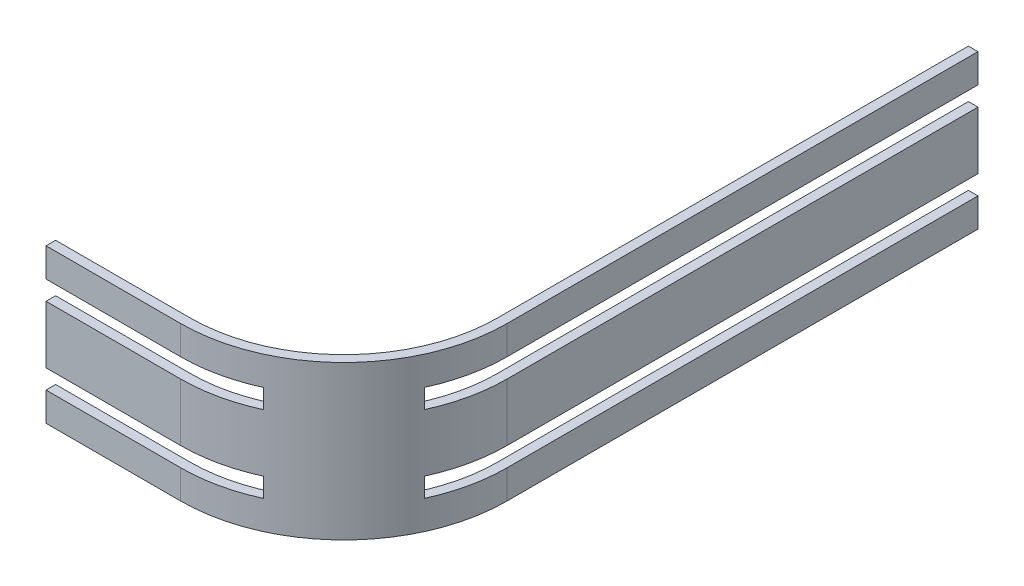
ISO-10303-21;
HEADER;
FILE_DESCRIPTION(('STEP AP214'),'2;1');
FILE_NAME('part.step','',(''),(''),'','','');
FILE_SCHEMA(('AUTOMOTIVE_DESIGN { 1 0 10303 214 1 1 1 1 }'));
ENDSEC;
DATA;
#1=APPLICATION_CONTEXT('core data for automotive mechanical design processes');
#2=APPLICATION_PROTOCOL_DEFINITION('international standard','automotive_design',2000,#1);
#3=PRODUCT_CONTEXT('',#1,'mechanical');
#4=PRODUCT('Part','Part','',(#3));
#5=PRODUCT_RELATED_PRODUCT_CATEGORY('part','',(#4));
#6=PRODUCT_DEFINITION_FORMATION('','',#4);
#7=PRODUCT_DEFINITION_CONTEXT('part definition',#1,'design');
#8=PRODUCT_DEFINITION('design','',#6,#7);
#9=PRODUCT_DEFINITION_SHAPE('','',#8);
#10=(LENGTH_UNIT() NAMED_UNIT(*) SI_UNIT(.MILLI.,.METRE.));
#11=(NAMED_UNIT(*) PLANE_ANGLE_UNIT() SI_UNIT($,.RADIAN.));
#12=(NAMED_UNIT(*) SI_UNIT($,.STERADIAN.) SOLID_ANGLE_UNIT());
#13=UNCERTAINTY_MEASURE_WITH_UNIT(LENGTH_MEASURE(1.E-05),#10,'distance_accuracy_value','');
#14=(GEOMETRIC_REPRESENTATION_CONTEXT(3) GLOBAL_UNCERTAINTY_ASSIGNED_CONTEXT((#13)) GLOBAL_UNIT_ASSIGNED_CONTEXT((#10,
#11,#12)) REPRESENTATION_CONTEXT('',''));
#15=CARTESIAN_POINT('',(0.,0.,0.));
#16=DIRECTION('',(0.,0.,1.));
#17=DIRECTION('',(1.,0.,0.));
#18=AXIS2_PLACEMENT_3D('',#15,#16,#17);
#19=CARTESIAN_POINT('',(-0.999999999999997,-3.,16.5));
#20=DIRECTION('',(0.,-1.,0.));
#21=DIRECTION('',(0.,0.,-1.));
#22=AXIS2_PLACEMENT_3D('',#19,#20,#21);
#23=PLANE('',#22);
#24=DIRECTION('',(0.,0.,-1.));
#25=VECTOR('',#24,1.);
#26=CARTESIAN_POINT('',(6.07499999999999,-3.,31.9578256879808));
#27=LINE('',#26,#25);
#28=CARTESIAN_POINT('',(6.07499999999999,-3.,31.9578256879808));
#29=VERTEX_POINT('',#28);
#30=CARTESIAN_POINT('',(6.07499999999999,-3.,30.8507621748812));
#31=VERTEX_POINT('',#30);
#32=EDGE_CURVE('E510',#29,#31,#27,.T.);
#33=ORIENTED_EDGE('',*,*,#32,.F.);
#34=CARTESIAN_POINT('',(-0.999999999999997,-3.,16.5));
#35=DIRECTION('',(0.,1.,0.));
#36=DIRECTION('',(0.,0.,-1.));
#37=AXIS2_PLACEMENT_3D('',#34,#35,#36);
#38=CIRCLE('',#37,17.);
#39=CARTESIAN_POINT('',(-1.00000000000012,-3.,33.5));
#40=VERTEX_POINT('',#39);
#41=EDGE_CURVE('E418',#40,#29,#38,.T.);
#42=ORIENTED_EDGE('',*,*,#41,.F.);
#43=DIRECTION('',(1.,0.,0.));
#44=VECTOR('',#43,1.);
#45=CARTESIAN_POINT('',(-15.,-3.,33.5));
#46=LINE('',#45,#44);
#47=CARTESIAN_POINT('',(-15.,-3.,33.5));
#48=VERTEX_POINT('',#47);
#49=EDGE_CURVE('E427',#48,#40,#46,.T.);
#50=ORIENTED_EDGE('',*,*,#49,.F.);
#51=DIRECTION('',(0.,0.,1.));
#52=VECTOR('',#51,1.);
#53=CARTESIAN_POINT('',(-15.,-3.,32.5));
#54=LINE('',#53,#52);
#55=CARTESIAN_POINT('',(-15.,-3.,32.5));
#56=VERTEX_POINT('',#55);
#57=EDGE_CURVE('E693',#56,#48,#54,.T.);
#58=ORIENTED_EDGE('',*,*,#57,.F.);
#59=DIRECTION('',(-1.,0.,0.));
#60=VECTOR('',#59,1.);
#61=CARTESIAN_POINT('',(-1.00000000000011,-3.,32.5));
#62=LINE('',#61,#60);
#63=CARTESIAN_POINT('',(-1.0000000000001,-3.,32.5));
#64=VERTEX_POINT('',#63);
#65=EDGE_CURVE('E498',#64,#56,#62,.T.);
#66=ORIENTED_EDGE('',*,*,#65,.F.);
#67=CARTESIAN_POINT('',(-0.999999999999997,-3.,16.5));
#68=DIRECTION('',(0.,-1.,0.));
#69=DIRECTION('',(0.,0.,-1.));
#70=AXIS2_PLACEMENT_3D('',#67,#68,#69);
#71=CIRCLE('',#70,16.);
#72=EDGE_CURVE('E50',#31,#64,#71,.T.);
#73=ORIENTED_EDGE('',*,*,#72,.F.);
#74=EDGE_LOOP('',(#33,#42,#50,#58,#66,#73));
#75=FACE_BOUND('',#74,.T.);
#76=ADVANCED_FACE('F32',(#75),#23,.T.);
#77=CARTESIAN_POINT('',(-0.999999999999997,3.,16.5));
#78=DIRECTION('',(0.,-1.,0.));
#79=DIRECTION('',(0.,0.,-1.));
#80=AXIS2_PLACEMENT_3D('',#77,#78,#79);
#81=PLANE('',#80);
#82=DIRECTION('',(0.,0.,1.));
#83=VECTOR('',#82,1.);
#84=CARTESIAN_POINT('',(6.07499999999999,3.,30.8507621748812));
#85=LINE('',#84,#83);
#86=CARTESIAN_POINT('',(6.07499999999999,3.,30.8507621748812));
#87=VERTEX_POINT('',#86);
#88=CARTESIAN_POINT('',(6.07499999999999,3.,31.9578256879808));
#89=VERTEX_POINT('',#88);
#90=EDGE_CURVE('E380',#87,#89,#85,.T.);
#91=ORIENTED_EDGE('',*,*,#90,.F.);
#92=CARTESIAN_POINT('',(-0.999999999999997,3.,16.5));
#93=DIRECTION('',(0.,-1.,0.));
#94=DIRECTION('',(0.,0.,-1.));
#95=AXIS2_PLACEMENT_3D('',#92,#93,#94);
#96=CIRCLE('',#95,16.);
#97=CARTESIAN_POINT('',(-1.0000000000001,3.,32.5));
#98=VERTEX_POINT('',#97);
#99=EDGE_CURVE('E457',#87,#98,#96,.T.);
#100=ORIENTED_EDGE('',*,*,#99,.T.);
#101=DIRECTION('',(-1.,0.,0.));
#102=VECTOR('',#101,1.);
#103=CARTESIAN_POINT('',(-1.00000000000011,3.,32.5));
#104=LINE('',#103,#102);
#105=CARTESIAN_POINT('',(-15.,3.,32.5));
#106=VERTEX_POINT('',#105);
#107=EDGE_CURVE('E456',#98,#106,#104,.T.);
#108=ORIENTED_EDGE('',*,*,#107,.T.);
#109=DIRECTION('',(0.,0.,1.));
#110=VECTOR('',#109,1.);
#111=CARTESIAN_POINT('',(-15.,3.,32.5));
#112=LINE('',#111,#110);
#113=CARTESIAN_POINT('',(-15.,3.,33.5));
#114=VERTEX_POINT('',#113);
#115=EDGE_CURVE('E464',#106,#114,#112,.T.);
#116=ORIENTED_EDGE('',*,*,#115,.T.);
#117=DIRECTION('',(1.,0.,0.));
#118=VECTOR('',#117,1.);
#119=CARTESIAN_POINT('',(-15.,3.,33.5));
#120=LINE('',#119,#118);
#121=CARTESIAN_POINT('',(-1.00000000000012,3.,33.5));
#122=VERTEX_POINT('',#121);
#123=EDGE_CURVE('E466',#114,#122,#120,.T.);
#124=ORIENTED_EDGE('',*,*,#123,.T.);
#125=CARTESIAN_POINT('',(-0.999999999999997,3.,16.5));
#126=DIRECTION('',(0.,1.,0.));
#127=DIRECTION('',(0.,0.,-1.));
#128=AXIS2_PLACEMENT_3D('',#125,#126,#127);
#129=CIRCLE('',#128,17.);
#130=EDGE_CURVE('E471',#122,#89,#129,.T.);
#131=ORIENTED_EDGE('',*,*,#130,.T.);
#132=EDGE_LOOP('',(#91,#100,#108,#116,#124,#131));
#133=FACE_BOUND('',#132,.T.);
#134=ADVANCED_FACE('F491',(#133),#81,.F.);
#135=DIRECTION('',(-1.,0.,0.));
#136=VECTOR('',#135,1.);
#137=CARTESIAN_POINT('',(13.3507621748812,3.,23.575));
#138=LINE('',#137,#136);
#139=CARTESIAN_POINT('',(14.4578256879808,3.,23.575));
#140=VERTEX_POINT('',#139);
#141=CARTESIAN_POINT('',(13.3507621748812,3.,23.575));
#142=VERTEX_POINT('',#141);
#143=EDGE_CURVE('E395',#140,#142,#138,.T.);
#144=ORIENTED_EDGE('',*,*,#143,.F.);
#145=CARTESIAN_POINT('',(16.,3.,16.4999999999999));
#146=VERTEX_POINT('',#145);
#147=EDGE_CURVE('E400',#140,#146,#129,.T.);
#148=ORIENTED_EDGE('',*,*,#147,.T.);
#149=DIRECTION('',(0.,0.,-1.));
#150=VECTOR('',#149,1.);
#151=CARTESIAN_POINT('',(16.,3.,16.4999999999999));
#152=LINE('',#151,#150);
#153=CARTESIAN_POINT('',(16.,3.,-32.5));
#154=VERTEX_POINT('',#153);
#155=EDGE_CURVE('E436',#146,#154,#152,.T.);
#156=ORIENTED_EDGE('',*,*,#155,.T.);
#157=DIRECTION('',(-1.,0.,0.));
#158=VECTOR('',#157,1.);
#159=CARTESIAN_POINT('',(16.,3.,-32.5));
#160=LINE('',#159,#158);
#161=CARTESIAN_POINT('',(15.,3.,-32.5));
#162=VERTEX_POINT('',#161);
#163=EDGE_CURVE('E431',#154,#162,#160,.T.);
#164=ORIENTED_EDGE('',*,*,#163,.T.);
#165=DIRECTION('',(0.,0.,1.));
#166=VECTOR('',#165,1.);
#167=CARTESIAN_POINT('',(15.,3.,-32.5));
#168=LINE('',#167,#166);
#169=CARTESIAN_POINT('',(15.,3.,16.4999999999999));
#170=VERTEX_POINT('',#169);
#171=EDGE_CURVE('E461',#162,#170,#168,.T.);
#172=ORIENTED_EDGE('',*,*,#171,.T.);
#173=EDGE_CURVE('E453',#170,#142,#96,.T.);
#174=ORIENTED_EDGE('',*,*,#173,.T.);
#175=EDGE_LOOP('',(#144,#148,#156,#164,#172,#174));
#176=FACE_BOUND('',#175,.T.);
#177=ADVANCED_FACE('F475',(#176),#81,.F.);
#178=CARTESIAN_POINT('',(16.,3.,-32.5));
#179=DIRECTION('',(0.,0.,1.));
#180=DIRECTION('',(1.,0.,0.));
#181=AXIS2_PLACEMENT_3D('',#178,#179,#180);
#182=PLANE('',#181);
#183=DIRECTION('',(-1.,0.,0.));
#184=VECTOR('',#183,1.);
#185=CARTESIAN_POINT('',(16.,-3.,-32.5));
#186=LINE('',#185,#184);
#187=CARTESIAN_POINT('',(16.,-3.,-32.5));
#188=VERTEX_POINT('',#187);
#189=CARTESIAN_POINT('',(15.,-3.,-32.5));
#190=VERTEX_POINT('',#189);
#191=EDGE_CURVE('E408',#188,#190,#186,.T.);
#192=ORIENTED_EDGE('',*,*,#191,.T.);
#193=DIRECTION('',(0.,-1.,0.));
#194=VECTOR('',#193,1.);
#195=CARTESIAN_POINT('',(15.,3.,-32.5));
#196=LINE('',#195,#194);
#197=EDGE_CURVE('E11',#162,#190,#196,.T.);
#198=ORIENTED_EDGE('',*,*,#197,.F.);
#199=ORIENTED_EDGE('',*,*,#163,.F.);
#200=DIRECTION('',(0.,-1.,0.));
#201=VECTOR('',#200,1.);
#202=CARTESIAN_POINT('',(16.,3.,-32.5));
#203=LINE('',#202,#201);
#204=EDGE_CURVE('E432',#154,#188,#203,.T.);
#205=ORIENTED_EDGE('',*,*,#204,.T.);
#206=EDGE_LOOP('',(#192,#198,#199,#205));
#207=FACE_BOUND('',#206,.T.);
#208=ADVANCED_FACE('F34',(#207),#182,.F.);
#209=CARTESIAN_POINT('',(15.,3.,-32.5));
#210=DIRECTION('',(1.,0.,0.));
#211=DIRECTION('',(0.,0.,-1.));
#212=AXIS2_PLACEMENT_3D('',#209,#210,#211);
#213=PLANE('',#212);
#214=DIRECTION('',(0.,0.,1.));
#215=VECTOR('',#214,1.);
#216=CARTESIAN_POINT('',(15.,-3.,-32.5));
#217=LINE('',#216,#215);
#218=CARTESIAN_POINT('',(15.,-3.,16.4999999999999));
#219=VERTEX_POINT('',#218);
#220=EDGE_CURVE('E690',#190,#219,#217,.T.);
#221=ORIENTED_EDGE('',*,*,#220,.T.);
#222=DIRECTION('',(0.,-1.,0.));
#223=VECTOR('',#222,1.);
#224=CARTESIAN_POINT('',(15.,3.,16.4999999999999));
#225=LINE('',#224,#223);
#226=EDGE_CURVE('E42',#170,#219,#225,.T.);
#227=ORIENTED_EDGE('',*,*,#226,.F.);
#228=ORIENTED_EDGE('',*,*,#171,.F.);
#229=ORIENTED_EDGE('',*,*,#197,.T.);
#230=EDGE_LOOP('',(#221,#227,#228,#229));
#231=FACE_BOUND('',#230,.T.);
#232=ADVANCED_FACE('F684',(#231),#213,.F.);
#233=CARTESIAN_POINT('',(-0.999999999999997,3.,16.5));
#234=DIRECTION('',(0.,-1.,0.));
#235=DIRECTION('',(0.,0.,-1.));
#236=AXIS2_PLACEMENT_3D('',#233,#234,#235);
#237=CYLINDRICAL_SURFACE('',#236,16.);
#238=CARTESIAN_POINT('',(13.3507621748812,-3.,23.575));
#239=VERTEX_POINT('',#238);
#240=EDGE_CURVE('E543',#219,#239,#71,.T.);
#241=ORIENTED_EDGE('',*,*,#240,.T.);
#242=DIRECTION('',(0.,1.,0.));
#243=VECTOR('',#242,1.);
#244=CARTESIAN_POINT('',(13.3507621748812,-5.,23.575));
#245=LINE('',#244,#243);
#246=CARTESIAN_POINT('',(13.3507621748812,-5.,23.575));
#247=VERTEX_POINT('',#246);
#248=EDGE_CURVE('E399',#247,#239,#245,.T.);
#249=ORIENTED_EDGE('',*,*,#248,.F.);
#250=CARTESIAN_POINT('',(-0.999999999999997,-5.,16.5));
#251=DIRECTION('',(0.,1.,0.));
#252=DIRECTION('',(0.,0.,-1.));
#253=AXIS2_PLACEMENT_3D('',#250,#251,#252);
#254=CIRCLE('',#253,16.);
#255=CARTESIAN_POINT('',(15.,-5.,16.4999999999999));
#256=VERTEX_POINT('',#255);
#257=EDGE_CURVE('E541',#247,#256,#254,.T.);
#258=ORIENTED_EDGE('',*,*,#257,.T.);
#259=DIRECTION('',(0.,1.,0.));
#260=VECTOR('',#259,1.);
#261=CARTESIAN_POINT('',(15.,-8.,16.4999999999999));
#262=LINE('',#261,#260);
#263=CARTESIAN_POINT('',(15.,-8.,16.4999999999999));
#264=VERTEX_POINT('',#263);
#265=EDGE_CURVE('E579',#264,#256,#262,.T.);
#266=ORIENTED_EDGE('',*,*,#265,.F.);
#267=CARTESIAN_POINT('',(-0.999999999999997,-8.,16.5));
#268=DIRECTION('',(0.,1.,0.));
#269=DIRECTION('',(0.,0.,-1.));
#270=AXIS2_PLACEMENT_3D('',#267,#268,#269);
#271=CIRCLE('',#270,16.);
#272=CARTESIAN_POINT('',(-1.0000000000001,-8.,32.5));
#273=VERTEX_POINT('',#272);
#274=EDGE_CURVE('E627',#273,#264,#271,.T.);
#275=ORIENTED_EDGE('',*,*,#274,.F.);
#276=DIRECTION('',(0.,1.,0.));
#277=VECTOR('',#276,1.);
#278=CARTESIAN_POINT('',(-1.0000000000001,-8.,32.5));
#279=LINE('',#278,#277);
#280=CARTESIAN_POINT('',(-1.0000000000001,-5.,32.5));
#281=VERTEX_POINT('',#280);
#282=EDGE_CURVE('E581',#273,#281,#279,.T.);
#283=ORIENTED_EDGE('',*,*,#282,.T.);
#284=CARTESIAN_POINT('',(6.07499999999999,-5.,30.8507621748812));
#285=VERTEX_POINT('',#284);
#286=EDGE_CURVE('E550',#281,#285,#254,.T.);
#287=ORIENTED_EDGE('',*,*,#286,.T.);
#288=DIRECTION('',(0.,1.,0.));
#289=VECTOR('',#288,1.);
#290=CARTESIAN_POINT('',(6.07499999999999,-5.,30.8507621748812));
#291=LINE('',#290,#289);
#292=EDGE_CURVE('E521',#285,#31,#291,.T.);
#293=ORIENTED_EDGE('',*,*,#292,.T.);
#294=ORIENTED_EDGE('',*,*,#72,.T.);
#295=DIRECTION('',(0.,-1.,0.));
#296=VECTOR('',#295,1.);
#297=CARTESIAN_POINT('',(-1.0000000000001,3.,32.5));
#298=LINE('',#297,#296);
#299=EDGE_CURVE('E448',#98,#64,#298,.T.);
#300=ORIENTED_EDGE('',*,*,#299,.F.);
#301=ORIENTED_EDGE('',*,*,#99,.F.);
#302=DIRECTION('',(0.,-1.,0.));
#303=VECTOR('',#302,1.);
#304=CARTESIAN_POINT('',(6.07499999999999,5.,30.8507621748812));
#305=LINE('',#304,#303);
#306=CARTESIAN_POINT('',(6.07499999999999,5.,30.8507621748812));
#307=VERTEX_POINT('',#306);
#308=EDGE_CURVE('E378',#307,#87,#305,.T.);
#309=ORIENTED_EDGE('',*,*,#308,.F.);
#310=CARTESIAN_POINT('',(-0.999999999999997,5.,16.5));
#311=DIRECTION('',(0.,-1.,0.));
#312=DIRECTION('',(0.,0.,1.));
#313=AXIS2_PLACEMENT_3D('',#310,#311,#312);
#314=CIRCLE('',#313,16.);
#315=CARTESIAN_POINT('',(-1.0000000000001,5.,32.5));
#316=VERTEX_POINT('',#315);
#317=EDGE_CURVE('E319',#307,#316,#314,.T.);
#318=ORIENTED_EDGE('',*,*,#317,.T.);
#319=DIRECTION('',(0.,-1.,0.));
#320=VECTOR('',#319,1.);
#321=CARTESIAN_POINT('',(-1.0000000000001,8.,32.5));
#322=LINE('',#321,#320);
#323=CARTESIAN_POINT('',(-1.0000000000001,8.,32.5));
#324=VERTEX_POINT('',#323);
#325=EDGE_CURVE('E301',#324,#316,#322,.T.);
#326=ORIENTED_EDGE('',*,*,#325,.F.);
#327=CARTESIAN_POINT('',(-0.999999999999997,8.,16.5));
#328=DIRECTION('',(0.,-1.,0.));
#329=DIRECTION('',(0.,0.,1.));
#330=AXIS2_PLACEMENT_3D('',#327,#328,#329);
#331=CIRCLE('',#330,16.);
#332=CARTESIAN_POINT('',(15.,8.,16.4999999999999));
#333=VERTEX_POINT('',#332);
#334=EDGE_CURVE('E312',#333,#324,#331,.T.);
#335=ORIENTED_EDGE('',*,*,#334,.F.);
#336=DIRECTION('',(0.,-1.,0.));
#337=VECTOR('',#336,1.);
#338=CARTESIAN_POINT('',(15.,8.,16.4999999999999));
#339=LINE('',#338,#337);
#340=CARTESIAN_POINT('',(15.,5.,16.4999999999999));
#341=VERTEX_POINT('',#340);
#342=EDGE_CURVE('E275',#333,#341,#339,.T.);
#343=ORIENTED_EDGE('',*,*,#342,.T.);
#344=CARTESIAN_POINT('',(13.3507621748812,5.,23.575));
#345=VERTEX_POINT('',#344);
#346=EDGE_CURVE('E310',#341,#345,#314,.T.);
#347=ORIENTED_EDGE('',*,*,#346,.T.);
#348=DIRECTION('',(0.,-1.,0.));
#349=VECTOR('',#348,1.);
#350=CARTESIAN_POINT('',(13.3507621748812,5.,23.575));
#351=LINE('',#350,#349);
#352=EDGE_CURVE('E403',#345,#142,#351,.T.);
#353=ORIENTED_EDGE('',*,*,#352,.T.);
#354=ORIENTED_EDGE('',*,*,#173,.F.);
#355=ORIENTED_EDGE('',*,*,#226,.T.);
#356=EDGE_LOOP('',(#241,#249,#258,#266,#275,#283,#287,#293,#294,#300,#301,#309,#318,#326,#335,
#343,#347,#353,#354,#355));
#357=FACE_BOUND('',#356,.T.);
#358=ADVANCED_FACE('F308',(#357),#237,.F.);
#359=CARTESIAN_POINT('',(-1.00000000000011,3.,32.5));
#360=DIRECTION('',(0.,0.,1.));
#361=DIRECTION('',(1.,0.,0.));
#362=AXIS2_PLACEMENT_3D('',#359,#360,#361);
#363=PLANE('',#362);
#364=ORIENTED_EDGE('',*,*,#65,.T.);
#365=DIRECTION('',(0.,-1.,0.));
#366=VECTOR('',#365,1.);
#367=CARTESIAN_POINT('',(-15.,3.,32.5));
#368=LINE('',#367,#366);
#369=EDGE_CURVE('E445',#106,#56,#368,.T.);
#370=ORIENTED_EDGE('',*,*,#369,.F.);
#371=ORIENTED_EDGE('',*,*,#107,.F.);
#372=ORIENTED_EDGE('',*,*,#299,.T.);
#373=EDGE_LOOP('',(#364,#370,#371,#372));
#374=FACE_BOUND('',#373,.T.);
#375=ADVANCED_FACE('F496',(#374),#363,.F.);
#376=CARTESIAN_POINT('',(-15.,3.,32.5));
#377=DIRECTION('',(1.,0.,0.));
#378=DIRECTION('',(0.,0.,-1.));
#379=AXIS2_PLACEMENT_3D('',#376,#377,#378);
#380=PLANE('',#379);
#381=ORIENTED_EDGE('',*,*,#57,.T.);
#382=DIRECTION('',(0.,-1.,0.));
#383=VECTOR('',#382,1.);
#384=CARTESIAN_POINT('',(-15.,3.,33.5));
#385=LINE('',#384,#383);
#386=EDGE_CURVE('E442',#114,#48,#385,.T.);
#387=ORIENTED_EDGE('',*,*,#386,.F.);
#388=ORIENTED_EDGE('',*,*,#115,.F.);
#389=ORIENTED_EDGE('',*,*,#369,.T.);
#390=EDGE_LOOP('',(#381,#387,#388,#389));
#391=FACE_BOUND('',#390,.T.);
#392=ADVANCED_FACE('F502',(#391),#380,.F.);
#393=CARTESIAN_POINT('',(-15.,3.,33.5));
#394=DIRECTION('',(0.,0.,-1.));
#395=DIRECTION('',(-1.,0.,0.));
#396=AXIS2_PLACEMENT_3D('',#393,#394,#395);
#397=PLANE('',#396);
#398=ORIENTED_EDGE('',*,*,#49,.T.);
#399=DIRECTION('',(0.,-1.,0.));
#400=VECTOR('',#399,1.);
#401=CARTESIAN_POINT('',(-1.00000000000012,3.,33.5));
#402=LINE('',#401,#400);
#403=EDGE_CURVE('E439',#122,#40,#402,.T.);
#404=ORIENTED_EDGE('',*,*,#403,.F.);
#405=ORIENTED_EDGE('',*,*,#123,.F.);
#406=ORIENTED_EDGE('',*,*,#386,.T.);
#407=EDGE_LOOP('',(#398,#404,#405,#406));
#408=FACE_BOUND('',#407,.T.);
#409=ADVANCED_FACE('F506',(#408),#397,.F.);
#410=CARTESIAN_POINT('',(-0.999999999999997,3.,16.5));
#411=DIRECTION('',(0.,-1.,0.));
#412=DIRECTION('',(0.,0.,-1.));
#413=AXIS2_PLACEMENT_3D('',#410,#411,#412);
#414=CYLINDRICAL_SURFACE('',#413,17.);
#415=ORIENTED_EDGE('',*,*,#41,.T.);
#416=DIRECTION('',(0.,1.,0.));
#417=VECTOR('',#416,1.);
#418=CARTESIAN_POINT('',(6.07499999999999,-5.,31.9578256879808));
#419=LINE('',#418,#417);
#420=CARTESIAN_POINT('',(6.07499999999999,-5.,31.9578256879808));
#421=VERTEX_POINT('',#420);
#422=EDGE_CURVE('E533',#421,#29,#419,.T.);
#423=ORIENTED_EDGE('',*,*,#422,.F.);
#424=CARTESIAN_POINT('',(-0.999999999999997,-5.,16.5));
#425=DIRECTION('',(0.,-1.,0.));
#426=DIRECTION('',(0.,0.,-1.));
#427=AXIS2_PLACEMENT_3D('',#424,#425,#426);
#428=CIRCLE('',#427,17.);
#429=CARTESIAN_POINT('',(-1.00000000000012,-5.,33.5));
#430=VERTEX_POINT('',#429);
#431=EDGE_CURVE('E273',#421,#430,#428,.T.);
#432=ORIENTED_EDGE('',*,*,#431,.T.);
#433=DIRECTION('',(0.,1.,0.));
#434=VECTOR('',#433,1.);
#435=CARTESIAN_POINT('',(-1.00000000000012,-8.,33.5));
#436=LINE('',#435,#434);
#437=CARTESIAN_POINT('',(-1.00000000000012,-8.,33.5));
#438=VERTEX_POINT('',#437);
#439=EDGE_CURVE('E590',#438,#430,#436,.T.);
#440=ORIENTED_EDGE('',*,*,#439,.F.);
#441=CARTESIAN_POINT('',(-0.999999999999997,-8.,16.5));
#442=DIRECTION('',(0.,-1.,0.));
#443=DIRECTION('',(0.,0.,-1.));
#444=AXIS2_PLACEMENT_3D('',#441,#442,#443);
#445=CIRCLE('',#444,17.);
#446=CARTESIAN_POINT('',(16.,-8.,16.4999999999999));
#447=VERTEX_POINT('',#446);
#448=EDGE_CURVE('E595',#447,#438,#445,.T.);
#449=ORIENTED_EDGE('',*,*,#448,.F.);
#450=DIRECTION('',(0.,1.,0.));
#451=VECTOR('',#450,1.);
#452=CARTESIAN_POINT('',(16.,-8.,16.4999999999999));
#453=LINE('',#452,#451);
#454=CARTESIAN_POINT('',(16.,-5.,16.4999999999999));
#455=VERTEX_POINT('',#454);
#456=EDGE_CURVE('E515',#447,#455,#453,.T.);
#457=ORIENTED_EDGE('',*,*,#456,.T.);
#458=CARTESIAN_POINT('',(14.4578256879808,-5.,23.575));
#459=VERTEX_POINT('',#458);
#460=EDGE_CURVE('E561',#455,#459,#428,.T.);
#461=ORIENTED_EDGE('',*,*,#460,.T.);
#462=DIRECTION('',(0.,1.,0.));
#463=VECTOR('',#462,1.);
#464=CARTESIAN_POINT('',(14.4578256879808,-5.,23.575));
#465=LINE('',#464,#463);
#466=CARTESIAN_POINT('',(14.4578256879808,-3.,23.575));
#467=VERTEX_POINT('',#466);
#468=EDGE_CURVE('E531',#459,#467,#465,.T.);
#469=ORIENTED_EDGE('',*,*,#468,.T.);
#470=CARTESIAN_POINT('',(16.,-3.,16.4999999999999));
#471=VERTEX_POINT('',#470);
#472=EDGE_CURVE('E422',#467,#471,#38,.T.);
#473=ORIENTED_EDGE('',*,*,#472,.T.);
#474=DIRECTION('',(0.,-1.,0.));
#475=VECTOR('',#474,1.);
#476=CARTESIAN_POINT('',(16.,3.,16.4999999999999));
#477=LINE('',#476,#475);
#478=EDGE_CURVE('E435',#146,#471,#477,.T.);
#479=ORIENTED_EDGE('',*,*,#478,.F.);
#480=ORIENTED_EDGE('',*,*,#147,.F.);
#481=DIRECTION('',(0.,-1.,0.));
#482=VECTOR('',#481,1.);
#483=CARTESIAN_POINT('',(14.4578256879808,5.,23.575));
#484=LINE('',#483,#482);
#485=CARTESIAN_POINT('',(14.4578256879808,5.,23.575));
#486=VERTEX_POINT('',#485);
#487=EDGE_CURVE('E349',#486,#140,#484,.T.);
#488=ORIENTED_EDGE('',*,*,#487,.F.);
#489=CARTESIAN_POINT('',(-0.999999999999997,5.,16.5));
#490=DIRECTION('',(0.,1.,0.));
#491=DIRECTION('',(0.,0.,1.));
#492=AXIS2_PLACEMENT_3D('',#489,#490,#491);
#493=CIRCLE('',#492,17.);
#494=CARTESIAN_POINT('',(16.,5.,16.4999999999999));
#495=VERTEX_POINT('',#494);
#496=EDGE_CURVE('E282',#486,#495,#493,.T.);
#497=ORIENTED_EDGE('',*,*,#496,.T.);
#498=DIRECTION('',(0.,-1.,0.));
#499=VECTOR('',#498,1.);
#500=CARTESIAN_POINT('',(16.,8.,16.4999999999999));
#501=LINE('',#500,#499);
#502=CARTESIAN_POINT('',(16.,8.,16.4999999999999));
#503=VERTEX_POINT('',#502);
#504=EDGE_CURVE('E289',#503,#495,#501,.T.);
#505=ORIENTED_EDGE('',*,*,#504,.F.);
#506=CARTESIAN_POINT('',(-0.999999999999997,8.,16.5));
#507=DIRECTION('',(0.,1.,0.));
#508=DIRECTION('',(0.,0.,1.));
#509=AXIS2_PLACEMENT_3D('',#506,#507,#508);
#510=CIRCLE('',#509,17.);
#511=CARTESIAN_POINT('',(-1.00000000000012,8.,33.5));
#512=VERTEX_POINT('',#511);
#513=EDGE_CURVE('E261',#512,#503,#510,.T.);
#514=ORIENTED_EDGE('',*,*,#513,.F.);
#515=DIRECTION('',(0.,-1.,0.));
#516=VECTOR('',#515,1.);
#517=CARTESIAN_POINT('',(-1.00000000000012,8.,33.5));
#518=LINE('',#517,#516);
#519=CARTESIAN_POINT('',(-1.00000000000012,5.,33.5));
#520=VERTEX_POINT('',#519);
#521=EDGE_CURVE('E292',#512,#520,#518,.T.);
#522=ORIENTED_EDGE('',*,*,#521,.T.);
#523=CARTESIAN_POINT('',(6.07499999999999,5.,31.9578256879808));
#524=VERTEX_POINT('',#523);
#525=EDGE_CURVE('E265',#520,#524,#493,.T.);
#526=ORIENTED_EDGE('',*,*,#525,.T.);
#527=DIRECTION('',(0.,-1.,0.));
#528=VECTOR('',#527,1.);
#529=CARTESIAN_POINT('',(6.07499999999999,5.,31.9578256879808));
#530=LINE('',#529,#528);
#531=EDGE_CURVE('E370',#524,#89,#530,.T.);
#532=ORIENTED_EDGE('',*,*,#531,.T.);
#533=ORIENTED_EDGE('',*,*,#130,.F.);
#534=ORIENTED_EDGE('',*,*,#403,.T.);
#535=EDGE_LOOP('',(#415,#423,#432,#440,#449,#457,#461,#469,#473,#479,#480,#488,#497,#505,#514,
#522,#526,#532,#533,#534));
#536=FACE_BOUND('',#535,.T.);
#537=ADVANCED_FACE('F346',(#536),#414,.T.);
#538=CARTESIAN_POINT('',(16.,3.,16.4999999999999));
#539=DIRECTION('',(-1.,0.,0.));
#540=DIRECTION('',(0.,0.,1.));
#541=AXIS2_PLACEMENT_3D('',#538,#539,#540);
#542=PLANE('',#541);
#543=DIRECTION('',(0.,0.,-1.));
#544=VECTOR('',#543,1.);
#545=CARTESIAN_POINT('',(16.,-3.,16.4999999999999));
#546=LINE('',#545,#544);
#547=EDGE_CURVE('E421',#471,#188,#546,.T.);
#548=ORIENTED_EDGE('',*,*,#547,.T.);
#549=ORIENTED_EDGE('',*,*,#204,.F.);
#550=ORIENTED_EDGE('',*,*,#155,.F.);
#551=ORIENTED_EDGE('',*,*,#478,.T.);
#552=EDGE_LOOP('',(#548,#549,#550,#551));
#553=FACE_BOUND('',#552,.T.);
#554=ADVANCED_FACE('F482',(#553),#542,.F.);
#555=DIRECTION('',(1.,0.,0.));
#556=VECTOR('',#555,1.);
#557=CARTESIAN_POINT('',(13.3507621748812,-3.,23.575));
#558=LINE('',#557,#556);
#559=EDGE_CURVE('E58',#239,#467,#558,.T.);
#560=ORIENTED_EDGE('',*,*,#559,.F.);
#561=ORIENTED_EDGE('',*,*,#240,.F.);
#562=ORIENTED_EDGE('',*,*,#220,.F.);
#563=ORIENTED_EDGE('',*,*,#191,.F.);
#564=ORIENTED_EDGE('',*,*,#547,.F.);
#565=ORIENTED_EDGE('',*,*,#472,.F.);
#566=EDGE_LOOP('',(#560,#561,#562,#563,#564,#565));
#567=FACE_BOUND('',#566,.T.);
#568=ADVANCED_FACE('F657',(#567),#23,.T.);
#569=CARTESIAN_POINT('',(13.3507621748812,5.,23.575));
#570=DIRECTION('',(0.,0.,1.));
#571=DIRECTION('',(1.,0.,0.));
#572=AXIS2_PLACEMENT_3D('',#569,#570,#571);
#573=PLANE('',#572);
#574=ORIENTED_EDGE('',*,*,#143,.T.);
#575=ORIENTED_EDGE('',*,*,#352,.F.);
#576=DIRECTION('',(-1.,0.,0.));
#577=VECTOR('',#576,1.);
#578=CARTESIAN_POINT('',(13.3507621748812,5.,23.575));
#579=LINE('',#578,#577);
#580=EDGE_CURVE('E36',#486,#345,#579,.T.);
#581=ORIENTED_EDGE('',*,*,#580,.F.);
#582=ORIENTED_EDGE('',*,*,#487,.T.);
#583=EDGE_LOOP('',(#574,#575,#581,#582));
#584=FACE_BOUND('',#583,.T.);
#585=ADVANCED_FACE('F664',(#584),#573,.F.);
#586=CARTESIAN_POINT('',(6.07499999999999,5.,30.8507621748812));
#587=DIRECTION('',(1.,0.,0.));
#588=DIRECTION('',(0.,0.,-1.));
#589=AXIS2_PLACEMENT_3D('',#586,#587,#588);
#590=PLANE('',#589);
#591=ORIENTED_EDGE('',*,*,#90,.T.);
#592=ORIENTED_EDGE('',*,*,#531,.F.);
#593=DIRECTION('',(0.,0.,1.));
#594=VECTOR('',#593,1.);
#595=CARTESIAN_POINT('',(6.07499999999999,5.,30.8507621748812));
#596=LINE('',#595,#594);
#597=EDGE_CURVE('E375',#307,#524,#596,.T.);
#598=ORIENTED_EDGE('',*,*,#597,.F.);
#599=ORIENTED_EDGE('',*,*,#308,.T.);
#600=EDGE_LOOP('',(#591,#592,#598,#599));
#601=FACE_BOUND('',#600,.T.);
#602=ADVANCED_FACE('F669',(#601),#590,.F.);
#603=CARTESIAN_POINT('',(13.3507621748812,-5.,23.575));
#604=DIRECTION('',(0.,0.,1.));
#605=DIRECTION('',(1.,0.,0.));
#606=AXIS2_PLACEMENT_3D('',#603,#604,#605);
#607=PLANE('',#606);
#608=ORIENTED_EDGE('',*,*,#559,.T.);
#609=ORIENTED_EDGE('',*,*,#468,.F.);
#610=DIRECTION('',(1.,0.,0.));
#611=VECTOR('',#610,1.);
#612=CARTESIAN_POINT('',(13.3507621748812,-5.,23.575));
#613=LINE('',#612,#611);
#614=EDGE_CURVE('E383',#247,#459,#613,.T.);
#615=ORIENTED_EDGE('',*,*,#614,.F.);
#616=ORIENTED_EDGE('',*,*,#248,.T.);
#617=EDGE_LOOP('',(#608,#609,#615,#616));
#618=FACE_BOUND('',#617,.T.);
#619=ADVANCED_FACE('F538',(#618),#607,.F.);
#620=CARTESIAN_POINT('',(6.07499999999999,-5.,31.9578256879808));
#621=DIRECTION('',(1.,0.,0.));
#622=DIRECTION('',(0.,0.,-1.));
#623=AXIS2_PLACEMENT_3D('',#620,#621,#622);
#624=PLANE('',#623);
#625=ORIENTED_EDGE('',*,*,#32,.T.);
#626=ORIENTED_EDGE('',*,*,#292,.F.);
#627=DIRECTION('',(0.,0.,-1.));
#628=VECTOR('',#627,1.);
#629=CARTESIAN_POINT('',(6.07499999999999,-5.,31.9578256879808));
#630=LINE('',#629,#628);
#631=EDGE_CURVE('E514',#421,#285,#630,.T.);
#632=ORIENTED_EDGE('',*,*,#631,.F.);
#633=ORIENTED_EDGE('',*,*,#422,.T.);
#634=EDGE_LOOP('',(#625,#626,#632,#633));
#635=FACE_BOUND('',#634,.T.);
#636=ADVANCED_FACE('F707',(#635),#624,.F.);
#637=CARTESIAN_POINT('',(-0.999999999999997,-5.,16.5));
#638=DIRECTION('',(0.,-1.,0.));
#639=DIRECTION('',(0.,0.,-1.));
#640=AXIS2_PLACEMENT_3D('',#637,#638,#639);
#641=PLANE('',#640);
#642=ORIENTED_EDGE('',*,*,#257,.F.);
#643=ORIENTED_EDGE('',*,*,#614,.T.);
#644=ORIENTED_EDGE('',*,*,#460,.F.);
#645=DIRECTION('',(0.,0.,1.));
#646=VECTOR('',#645,1.);
#647=CARTESIAN_POINT('',(16.,-5.,16.4999999999999));
#648=LINE('',#647,#646);
#649=CARTESIAN_POINT('',(16.,-5.,-32.5));
#650=VERTEX_POINT('',#649);
#651=EDGE_CURVE('E270',#650,#455,#648,.T.);
#652=ORIENTED_EDGE('',*,*,#651,.F.);
#653=DIRECTION('',(1.,0.,0.));
#654=VECTOR('',#653,1.);
#655=CARTESIAN_POINT('',(16.,-5.,-32.5));
#656=LINE('',#655,#654);
#657=CARTESIAN_POINT('',(15.,-5.,-32.5));
#658=VERTEX_POINT('',#657);
#659=EDGE_CURVE('E569',#658,#650,#656,.T.);
#660=ORIENTED_EDGE('',*,*,#659,.F.);
#661=DIRECTION('',(0.,0.,-1.));
#662=VECTOR('',#661,1.);
#663=CARTESIAN_POINT('',(15.,-5.,-32.5));
#664=LINE('',#663,#662);
#665=EDGE_CURVE('E549',#256,#658,#664,.T.);
#666=ORIENTED_EDGE('',*,*,#665,.F.);
#667=EDGE_LOOP('',(#642,#643,#644,#652,#660,#666));
#668=FACE_BOUND('',#667,.T.);
#669=ADVANCED_FACE('F546',(#668),#641,.F.);
#670=ORIENTED_EDGE('',*,*,#431,.F.);
#671=ORIENTED_EDGE('',*,*,#631,.T.);
#672=ORIENTED_EDGE('',*,*,#286,.F.);
#673=DIRECTION('',(1.,0.,0.));
#674=VECTOR('',#673,1.);
#675=CARTESIAN_POINT('',(-1.0000000000001,-5.,32.5));
#676=LINE('',#675,#674);
#677=CARTESIAN_POINT('',(-15.,-5.,32.5));
#678=VERTEX_POINT('',#677);
#679=EDGE_CURVE('E551',#678,#281,#676,.T.);
#680=ORIENTED_EDGE('',*,*,#679,.F.);
#681=DIRECTION('',(0.,0.,-1.));
#682=VECTOR('',#681,1.);
#683=CARTESIAN_POINT('',(-15.,-5.,32.5));
#684=LINE('',#683,#682);
#685=CARTESIAN_POINT('',(-15.,-5.,33.5));
#686=VERTEX_POINT('',#685);
#687=EDGE_CURVE('E556',#686,#678,#684,.T.);
#688=ORIENTED_EDGE('',*,*,#687,.F.);
#689=DIRECTION('',(-1.,0.,0.));
#690=VECTOR('',#689,1.);
#691=CARTESIAN_POINT('',(-15.,-5.,33.5));
#692=LINE('',#691,#690);
#693=EDGE_CURVE('E602',#430,#686,#692,.T.);
#694=ORIENTED_EDGE('',*,*,#693,.F.);
#695=EDGE_LOOP('',(#670,#671,#672,#680,#688,#694));
#696=FACE_BOUND('',#695,.T.);
#697=ADVANCED_FACE('F623',(#696),#641,.F.);
#698=CARTESIAN_POINT('',(16.,-8.,16.4999999999999));
#699=DIRECTION('',(-1.,0.,0.));
#700=DIRECTION('',(0.,0.,1.));
#701=AXIS2_PLACEMENT_3D('',#698,#699,#700);
#702=PLANE('',#701);
#703=ORIENTED_EDGE('',*,*,#651,.T.);
#704=ORIENTED_EDGE('',*,*,#456,.F.);
#705=DIRECTION('',(0.,0.,1.));
#706=VECTOR('',#705,1.);
#707=CARTESIAN_POINT('',(16.,-8.,16.4999999999999));
#708=LINE('',#707,#706);
#709=CARTESIAN_POINT('',(16.,-8.,-32.5));
#710=VERTEX_POINT('',#709);
#711=EDGE_CURVE('E571',#710,#447,#708,.T.);
#712=ORIENTED_EDGE('',*,*,#711,.F.);
#713=DIRECTION('',(0.,1.,0.));
#714=VECTOR('',#713,1.);
#715=CARTESIAN_POINT('',(16.,-8.,-32.5));
#716=LINE('',#715,#714);
#717=EDGE_CURVE('E572',#710,#650,#716,.T.);
#718=ORIENTED_EDGE('',*,*,#717,.T.);
#719=EDGE_LOOP('',(#703,#704,#712,#718));
#720=FACE_BOUND('',#719,.T.);
#721=ADVANCED_FACE('F600',(#720),#702,.F.);
#722=CARTESIAN_POINT('',(-15.,-8.,33.5));
#723=DIRECTION('',(0.,0.,-1.));
#724=DIRECTION('',(-1.,0.,0.));
#725=AXIS2_PLACEMENT_3D('',#722,#723,#724);
#726=PLANE('',#725);
#727=ORIENTED_EDGE('',*,*,#693,.T.);
#728=DIRECTION('',(0.,1.,0.));
#729=VECTOR('',#728,1.);
#730=CARTESIAN_POINT('',(-15.,-8.,33.5));
#731=LINE('',#730,#729);
#732=CARTESIAN_POINT('',(-15.,-8.,33.5));
#733=VERTEX_POINT('',#732);
#734=EDGE_CURVE('E587',#733,#686,#731,.T.);
#735=ORIENTED_EDGE('',*,*,#734,.F.);
#736=DIRECTION('',(-1.,0.,0.));
#737=VECTOR('',#736,1.);
#738=CARTESIAN_POINT('',(-15.,-8.,33.5));
#739=LINE('',#738,#737);
#740=EDGE_CURVE('E641',#438,#733,#739,.T.);
#741=ORIENTED_EDGE('',*,*,#740,.F.);
#742=ORIENTED_EDGE('',*,*,#439,.T.);
#743=EDGE_LOOP('',(#727,#735,#741,#742));
#744=FACE_BOUND('',#743,.T.);
#745=ADVANCED_FACE('F646',(#744),#726,.F.);
#746=CARTESIAN_POINT('',(-15.,-8.,32.5));
#747=DIRECTION('',(1.,0.,0.));
#748=DIRECTION('',(0.,0.,-1.));
#749=AXIS2_PLACEMENT_3D('',#746,#747,#748);
#750=PLANE('',#749);
#751=ORIENTED_EDGE('',*,*,#687,.T.);
#752=DIRECTION('',(0.,1.,0.));
#753=VECTOR('',#752,1.);
#754=CARTESIAN_POINT('',(-15.,-8.,32.5));
#755=LINE('',#754,#753);
#756=CARTESIAN_POINT('',(-15.,-8.,32.5));
#757=VERTEX_POINT('',#756);
#758=EDGE_CURVE('E584',#757,#678,#755,.T.);
#759=ORIENTED_EDGE('',*,*,#758,.F.);
#760=DIRECTION('',(0.,0.,-1.));
#761=VECTOR('',#760,1.);
#762=CARTESIAN_POINT('',(-15.,-8.,32.5));
#763=LINE('',#762,#761);
#764=EDGE_CURVE('E633',#733,#757,#763,.T.);
#765=ORIENTED_EDGE('',*,*,#764,.F.);
#766=ORIENTED_EDGE('',*,*,#734,.T.);
#767=EDGE_LOOP('',(#751,#759,#765,#766));
#768=FACE_BOUND('',#767,.T.);
#769=ADVANCED_FACE('F612',(#768),#750,.F.);
#770=CARTESIAN_POINT('',(-1.0000000000001,-8.,32.5));
#771=DIRECTION('',(0.,0.,1.));
#772=DIRECTION('',(1.,0.,0.));
#773=AXIS2_PLACEMENT_3D('',#770,#771,#772);
#774=PLANE('',#773);
#775=ORIENTED_EDGE('',*,*,#679,.T.);
#776=ORIENTED_EDGE('',*,*,#282,.F.);
#777=DIRECTION('',(1.,0.,0.));
#778=VECTOR('',#777,1.);
#779=CARTESIAN_POINT('',(-1.0000000000001,-8.,32.5));
#780=LINE('',#779,#778);
#781=EDGE_CURVE('E622',#757,#273,#780,.T.);
#782=ORIENTED_EDGE('',*,*,#781,.F.);
#783=ORIENTED_EDGE('',*,*,#758,.T.);
#784=EDGE_LOOP('',(#775,#776,#782,#783));
#785=FACE_BOUND('',#784,.T.);
#786=ADVANCED_FACE('F620',(#785),#774,.F.);
#787=CARTESIAN_POINT('',(15.,-8.,-32.5));
#788=DIRECTION('',(1.,0.,0.));
#789=DIRECTION('',(0.,0.,-1.));
#790=AXIS2_PLACEMENT_3D('',#787,#788,#789);
#791=PLANE('',#790);
#792=ORIENTED_EDGE('',*,*,#665,.T.);
#793=DIRECTION('',(0.,1.,0.));
#794=VECTOR('',#793,1.);
#795=CARTESIAN_POINT('',(15.,-8.,-32.5));
#796=LINE('',#795,#794);
#797=CARTESIAN_POINT('',(15.,-8.,-32.5));
#798=VERTEX_POINT('',#797);
#799=EDGE_CURVE('E575',#798,#658,#796,.T.);
#800=ORIENTED_EDGE('',*,*,#799,.F.);
#801=DIRECTION('',(0.,0.,-1.));
#802=VECTOR('',#801,1.);
#803=CARTESIAN_POINT('',(15.,-8.,-32.5));
#804=LINE('',#803,#802);
#805=EDGE_CURVE('E630',#264,#798,#804,.T.);
#806=ORIENTED_EDGE('',*,*,#805,.F.);
#807=ORIENTED_EDGE('',*,*,#265,.T.);
#808=EDGE_LOOP('',(#792,#800,#806,#807));
#809=FACE_BOUND('',#808,.T.);
#810=ADVANCED_FACE('F721',(#809),#791,.F.);
#811=CARTESIAN_POINT('',(16.,-8.,-32.5));
#812=DIRECTION('',(0.,0.,1.));
#813=DIRECTION('',(1.,0.,0.));
#814=AXIS2_PLACEMENT_3D('',#811,#812,#813);
#815=PLANE('',#814);
#816=ORIENTED_EDGE('',*,*,#659,.T.);
#817=ORIENTED_EDGE('',*,*,#717,.F.);
#818=DIRECTION('',(1.,0.,0.));
#819=VECTOR('',#818,1.);
#820=CARTESIAN_POINT('',(16.,-8.,-32.5));
#821=LINE('',#820,#819);
#822=EDGE_CURVE('E576',#798,#710,#821,.T.);
#823=ORIENTED_EDGE('',*,*,#822,.F.);
#824=ORIENTED_EDGE('',*,*,#799,.T.);
#825=EDGE_LOOP('',(#816,#817,#823,#824));
#826=FACE_BOUND('',#825,.T.);
#827=ADVANCED_FACE('F640',(#826),#815,.F.);
#828=CARTESIAN_POINT('',(-0.999999999999997,-8.,16.5));
#829=DIRECTION('',(0.,-1.,0.));
#830=DIRECTION('',(0.,0.,-1.));
#831=AXIS2_PLACEMENT_3D('',#828,#829,#830);
#832=PLANE('',#831);
#833=ORIENTED_EDGE('',*,*,#711,.T.);
#834=ORIENTED_EDGE('',*,*,#448,.T.);
#835=ORIENTED_EDGE('',*,*,#740,.T.);
#836=ORIENTED_EDGE('',*,*,#764,.T.);
#837=ORIENTED_EDGE('',*,*,#781,.T.);
#838=ORIENTED_EDGE('',*,*,#274,.T.);
#839=ORIENTED_EDGE('',*,*,#805,.T.);
#840=ORIENTED_EDGE('',*,*,#822,.T.);
#841=EDGE_LOOP('',(#833,#834,#835,#836,#837,#838,#839,#840));
#842=FACE_BOUND('',#841,.T.);
#843=ADVANCED_FACE('F637',(#842),#832,.T.);
#844=CARTESIAN_POINT('',(-0.999999999999997,5.,16.5));
#845=DIRECTION('',(0.,1.,0.));
#846=DIRECTION('',(0.,0.,1.));
#847=AXIS2_PLACEMENT_3D('',#844,#845,#846);
#848=PLANE('',#847);
#849=ORIENTED_EDGE('',*,*,#496,.F.);
#850=ORIENTED_EDGE('',*,*,#580,.T.);
#851=ORIENTED_EDGE('',*,*,#346,.F.);
#852=DIRECTION('',(0.,0.,1.));
#853=VECTOR('',#852,1.);
#854=CARTESIAN_POINT('',(15.,5.,-32.5));
#855=LINE('',#854,#853);
#856=CARTESIAN_POINT('',(15.,5.,-32.5));
#857=VERTEX_POINT('',#856);
#858=EDGE_CURVE('E317',#857,#341,#855,.T.);
#859=ORIENTED_EDGE('',*,*,#858,.F.);
#860=DIRECTION('',(-1.,0.,0.));
#861=VECTOR('',#860,1.);
#862=CARTESIAN_POINT('',(16.,5.,-32.5));
#863=LINE('',#862,#861);
#864=CARTESIAN_POINT('',(16.,5.,-32.5));
#865=VERTEX_POINT('',#864);
#866=EDGE_CURVE('E320',#865,#857,#863,.T.);
#867=ORIENTED_EDGE('',*,*,#866,.F.);
#868=DIRECTION('',(0.,0.,-1.));
#869=VECTOR('',#868,1.);
#870=CARTESIAN_POINT('',(16.,5.,16.4999999999999));
#871=LINE('',#870,#869);
#872=EDGE_CURVE('E269',#495,#865,#871,.T.);
#873=ORIENTED_EDGE('',*,*,#872,.F.);
#874=EDGE_LOOP('',(#849,#850,#851,#859,#867,#873));
#875=FACE_BOUND('',#874,.T.);
#876=ADVANCED_FACE('F351',(#875),#848,.F.);
#877=ORIENTED_EDGE('',*,*,#317,.F.);
#878=ORIENTED_EDGE('',*,*,#597,.T.);
#879=ORIENTED_EDGE('',*,*,#525,.F.);
#880=DIRECTION('',(1.,0.,0.));
#881=VECTOR('',#880,1.);
#882=CARTESIAN_POINT('',(-15.,5.,33.5));
#883=LINE('',#882,#881);
#884=CARTESIAN_POINT('',(-15.,5.,33.5));
#885=VERTEX_POINT('',#884);
#886=EDGE_CURVE('E287',#885,#520,#883,.T.);
#887=ORIENTED_EDGE('',*,*,#886,.F.);
#888=DIRECTION('',(0.,0.,1.));
#889=VECTOR('',#888,1.);
#890=CARTESIAN_POINT('',(-15.,5.,32.5));
#891=LINE('',#890,#889);
#892=CARTESIAN_POINT('',(-15.,5.,32.5));
#893=VERTEX_POINT('',#892);
#894=EDGE_CURVE('E331',#893,#885,#891,.T.);
#895=ORIENTED_EDGE('',*,*,#894,.F.);
#896=DIRECTION('',(-1.,0.,0.));
#897=VECTOR('',#896,1.);
#898=CARTESIAN_POINT('',(-1.0000000000001,5.,32.5));
#899=LINE('',#898,#897);
#900=EDGE_CURVE('E328',#316,#893,#899,.T.);
#901=ORIENTED_EDGE('',*,*,#900,.F.);
#902=EDGE_LOOP('',(#877,#878,#879,#887,#895,#901));
#903=FACE_BOUND('',#902,.T.);
#904=ADVANCED_FACE('F373',(#903),#848,.F.);
#905=CARTESIAN_POINT('',(16.,8.,16.4999999999999));
#906=DIRECTION('',(-1.,0.,0.));
#907=DIRECTION('',(0.,0.,1.));
#908=AXIS2_PLACEMENT_3D('',#905,#906,#907);
#909=PLANE('',#908);
#910=ORIENTED_EDGE('',*,*,#872,.T.);
#911=DIRECTION('',(0.,-1.,0.));
#912=VECTOR('',#911,1.);
#913=CARTESIAN_POINT('',(16.,8.,-32.5));
#914=LINE('',#913,#912);
#915=CARTESIAN_POINT('',(16.,8.,-32.5));
#916=VERTEX_POINT('',#915);
#917=EDGE_CURVE('E249',#916,#865,#914,.T.);
#918=ORIENTED_EDGE('',*,*,#917,.F.);
#919=DIRECTION('',(0.,0.,-1.));
#920=VECTOR('',#919,1.);
#921=CARTESIAN_POINT('',(16.,8.,16.4999999999999));
#922=LINE('',#921,#920);
#923=EDGE_CURVE('E256',#503,#916,#922,.T.);
#924=ORIENTED_EDGE('',*,*,#923,.F.);
#925=ORIENTED_EDGE('',*,*,#504,.T.);
#926=EDGE_LOOP('',(#910,#918,#924,#925));
#927=FACE_BOUND('',#926,.T.);
#928=ADVANCED_FACE('F267',(#927),#909,.F.);
#929=CARTESIAN_POINT('',(16.,8.,-32.5));
#930=DIRECTION('',(0.,0.,1.));
#931=DIRECTION('',(1.,0.,0.));
#932=AXIS2_PLACEMENT_3D('',#929,#930,#931);
#933=PLANE('',#932);
#934=ORIENTED_EDGE('',*,*,#866,.T.);
#935=DIRECTION('',(0.,-1.,0.));
#936=VECTOR('',#935,1.);
#937=CARTESIAN_POINT('',(15.,8.,-32.5));
#938=LINE('',#937,#936);
#939=CARTESIAN_POINT('',(15.,8.,-32.5));
#940=VERTEX_POINT('',#939);
#941=EDGE_CURVE('E252',#940,#857,#938,.T.);
#942=ORIENTED_EDGE('',*,*,#941,.F.);
#943=DIRECTION('',(-1.,0.,0.));
#944=VECTOR('',#943,1.);
#945=CARTESIAN_POINT('',(16.,8.,-32.5));
#946=LINE('',#945,#944);
#947=EDGE_CURVE('E245',#916,#940,#946,.T.);
#948=ORIENTED_EDGE('',*,*,#947,.F.);
#949=ORIENTED_EDGE('',*,*,#917,.T.);
#950=EDGE_LOOP('',(#934,#942,#948,#949));
#951=FACE_BOUND('',#950,.T.);
#952=ADVANCED_FACE('F247',(#951),#933,.F.);
#953=CARTESIAN_POINT('',(15.,8.,-32.5));
#954=DIRECTION('',(1.,0.,0.));
#955=DIRECTION('',(0.,0.,-1.));
#956=AXIS2_PLACEMENT_3D('',#953,#954,#955);
#957=PLANE('',#956);
#958=ORIENTED_EDGE('',*,*,#858,.T.);
#959=ORIENTED_EDGE('',*,*,#342,.F.);
#960=DIRECTION('',(0.,0.,1.));
#961=VECTOR('',#960,1.);
#962=CARTESIAN_POINT('',(15.,8.,-32.5));
#963=LINE('',#962,#961);
#964=EDGE_CURVE('E255',#940,#333,#963,.T.);
#965=ORIENTED_EDGE('',*,*,#964,.F.);
#966=ORIENTED_EDGE('',*,*,#941,.T.);
#967=EDGE_LOOP('',(#958,#959,#965,#966));
#968=FACE_BOUND('',#967,.T.);
#969=ADVANCED_FACE('F315',(#968),#957,.F.);
#970=CARTESIAN_POINT('',(-1.0000000000001,8.,32.5));
#971=DIRECTION('',(0.,0.,1.));
#972=DIRECTION('',(1.,0.,0.));
#973=AXIS2_PLACEMENT_3D('',#970,#971,#972);
#974=PLANE('',#973);
#975=ORIENTED_EDGE('',*,*,#900,.T.);
#976=DIRECTION('',(0.,-1.,0.));
#977=VECTOR('',#976,1.);
#978=CARTESIAN_POINT('',(-15.,8.,32.5));
#979=LINE('',#978,#977);
#980=CARTESIAN_POINT('',(-15.,8.,32.5));
#981=VERTEX_POINT('',#980);
#982=EDGE_CURVE('E298',#981,#893,#979,.T.);
#983=ORIENTED_EDGE('',*,*,#982,.F.);
#984=DIRECTION('',(-1.,0.,0.));
#985=VECTOR('',#984,1.);
#986=CARTESIAN_POINT('',(-1.0000000000001,8.,32.5));
#987=LINE('',#986,#985);
#988=EDGE_CURVE('E358',#324,#981,#987,.T.);
#989=ORIENTED_EDGE('',*,*,#988,.F.);
#990=ORIENTED_EDGE('',*,*,#325,.T.);
#991=EDGE_LOOP('',(#975,#983,#989,#990));
#992=FACE_BOUND('',#991,.T.);
#993=ADVANCED_FACE('F363',(#992),#974,.F.);
#994=CARTESIAN_POINT('',(-15.,8.,32.5));
#995=DIRECTION('',(1.,0.,0.));
#996=DIRECTION('',(0.,0.,-1.));
#997=AXIS2_PLACEMENT_3D('',#994,#995,#996);
#998=PLANE('',#997);
#999=ORIENTED_EDGE('',*,*,#894,.T.);
#1000=DIRECTION('',(0.,-1.,0.));
#1001=VECTOR('',#1000,1.);
#1002=CARTESIAN_POINT('',(-15.,8.,33.5));
#1003=LINE('',#1002,#1001);
#1004=CARTESIAN_POINT('',(-15.,8.,33.5));
#1005=VERTEX_POINT('',#1004);
#1006=EDGE_CURVE('E295',#1005,#885,#1003,.T.);
#1007=ORIENTED_EDGE('',*,*,#1006,.F.);
#1008=DIRECTION('',(0.,0.,1.));
#1009=VECTOR('',#1008,1.);
#1010=CARTESIAN_POINT('',(-15.,8.,32.5));
#1011=LINE('',#1010,#1009);
#1012=EDGE_CURVE('E356',#981,#1005,#1011,.T.);
#1013=ORIENTED_EDGE('',*,*,#1012,.F.);
#1014=ORIENTED_EDGE('',*,*,#982,.T.);
#1015=EDGE_LOOP('',(#999,#1007,#1013,#1014));
#1016=FACE_BOUND('',#1015,.T.);
#1017=ADVANCED_FACE('F365',(#1016),#998,.F.);
#1018=CARTESIAN_POINT('',(-15.,8.,33.5));
#1019=DIRECTION('',(0.,0.,-1.));
#1020=DIRECTION('',(-1.,0.,0.));
#1021=AXIS2_PLACEMENT_3D('',#1018,#1019,#1020);
#1022=PLANE('',#1021);
#1023=ORIENTED_EDGE('',*,*,#886,.T.);
#1024=ORIENTED_EDGE('',*,*,#521,.F.);
#1025=DIRECTION('',(1.,0.,0.));
#1026=VECTOR('',#1025,1.);
#1027=CARTESIAN_POINT('',(-15.,8.,33.5));
#1028=LINE('',#1027,#1026);
#1029=EDGE_CURVE('E354',#1005,#512,#1028,.T.);
#1030=ORIENTED_EDGE('',*,*,#1029,.F.);
#1031=ORIENTED_EDGE('',*,*,#1006,.T.);
#1032=EDGE_LOOP('',(#1023,#1024,#1030,#1031));
#1033=FACE_BOUND('',#1032,.T.);
#1034=ADVANCED_FACE('F367',(#1033),#1022,.F.);
#1035=CARTESIAN_POINT('',(-0.999999999999997,8.,16.5));
#1036=DIRECTION('',(0.,1.,0.));
#1037=DIRECTION('',(0.,0.,1.));
#1038=AXIS2_PLACEMENT_3D('',#1035,#1036,#1037);
#1039=PLANE('',#1038);
#1040=ORIENTED_EDGE('',*,*,#923,.T.);
#1041=ORIENTED_EDGE('',*,*,#947,.T.);
#1042=ORIENTED_EDGE('',*,*,#964,.T.);
#1043=ORIENTED_EDGE('',*,*,#334,.T.);
#1044=ORIENTED_EDGE('',*,*,#988,.T.);
#1045=ORIENTED_EDGE('',*,*,#1012,.T.);
#1046=ORIENTED_EDGE('',*,*,#1029,.T.);
#1047=ORIENTED_EDGE('',*,*,#513,.T.);
#1048=EDGE_LOOP('',(#1040,#1041,#1042,#1043,#1044,#1045,#1046,#1047));
#1049=FACE_BOUND('',#1048,.T.);
#1050=ADVANCED_FACE('F259',(#1049),#1039,.T.);
#1051=CLOSED_SHELL('',(#76,#134,#177,#208,#232,#358,#375,#392,#409,#537,#554,#568,#585,#602,
#619,#636,#669,#697,#721,#745,#769,#786,#810,#827,#843,#876,#904,#928,#952,#969,#993,#1017,
#1034,#1050));
#1052=MANIFOLD_SOLID_BREP('B2',#1051);
#1053=ADVANCED_BREP_SHAPE_REPRESENTATION('',(#18,#1052),#14);
#1054=SHAPE_DEFINITION_REPRESENTATION(#9,#1053);
ENDSEC;
END-ISO-10303-21;
